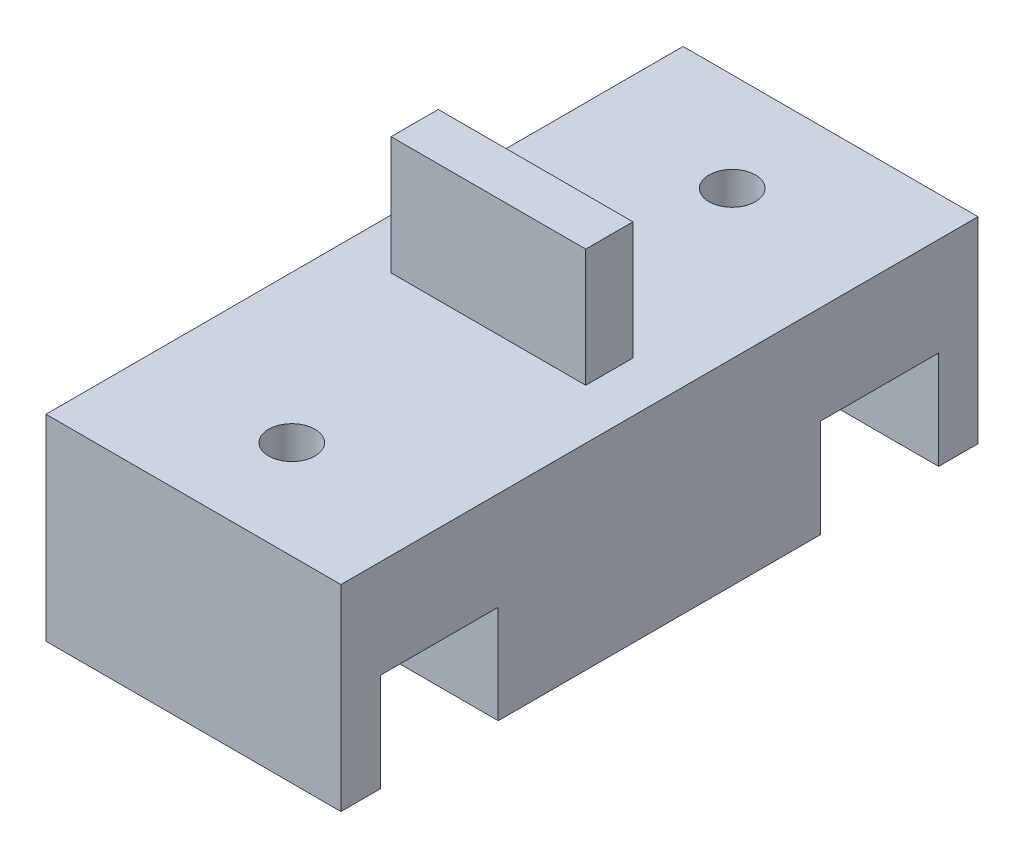
ISO-10303-21;
HEADER;
FILE_DESCRIPTION(('STEP AP214'),'2;1');
FILE_NAME('part.step','',(''),(''),'','','');
FILE_SCHEMA(('AUTOMOTIVE_DESIGN { 1 0 10303 214 1 1 1 1 }'));
ENDSEC;
DATA;
#1=APPLICATION_CONTEXT('core data for automotive mechanical design processes');
#2=APPLICATION_PROTOCOL_DEFINITION('international standard','automotive_design',2000,#1);
#3=PRODUCT_CONTEXT('',#1,'mechanical');
#4=PRODUCT('Part','Part','',(#3));
#5=PRODUCT_RELATED_PRODUCT_CATEGORY('part','',(#4));
#6=PRODUCT_DEFINITION_FORMATION('','',#4);
#7=PRODUCT_DEFINITION_CONTEXT('part definition',#1,'design');
#8=PRODUCT_DEFINITION('design','',#6,#7);
#9=PRODUCT_DEFINITION_SHAPE('','',#8);
#10=(LENGTH_UNIT() NAMED_UNIT(*) SI_UNIT(.MILLI.,.METRE.));
#11=(NAMED_UNIT(*) PLANE_ANGLE_UNIT() SI_UNIT($,.RADIAN.));
#12=(NAMED_UNIT(*) SI_UNIT($,.STERADIAN.) SOLID_ANGLE_UNIT());
#13=UNCERTAINTY_MEASURE_WITH_UNIT(LENGTH_MEASURE(1.E-05),#10,'distance_accuracy_value','');
#14=(GEOMETRIC_REPRESENTATION_CONTEXT(3) GLOBAL_UNCERTAINTY_ASSIGNED_CONTEXT((#13)) GLOBAL_UNIT_ASSIGNED_CONTEXT((#10,
#11,#12)) REPRESENTATION_CONTEXT('',''));
#15=CARTESIAN_POINT('',(0.,0.,0.));
#16=DIRECTION('',(0.,0.,1.));
#17=DIRECTION('',(1.,0.,0.));
#18=AXIS2_PLACEMENT_3D('',#15,#16,#17);
#19=CARTESIAN_POINT('',(9.525,0.,0.));
#20=DIRECTION('',(0.,1.,0.));
#21=DIRECTION('',(0.,0.,1.));
#22=AXIS2_PLACEMENT_3D('',#19,#20,#21);
#23=PLANE('',#22);
#24=DIRECTION('',(-1.,0.,0.));
#25=VECTOR('',#24,1.);
#26=CARTESIAN_POINT('',(0.,0.,-18.034));
#27=LINE('',#26,#25);
#28=CARTESIAN_POINT('',(9.525,0.,-18.034));
#29=VERTEX_POINT('',#28);
#30=CARTESIAN_POINT('',(-9.525,0.,-18.034));
#31=VERTEX_POINT('',#30);
#32=EDGE_CURVE('E157',#29,#31,#27,.T.);
#33=ORIENTED_EDGE('',*,*,#32,.T.);
#34=DIRECTION('',(0.,0.,-1.));
#35=VECTOR('',#34,1.);
#36=CARTESIAN_POINT('',(-9.525,0.,0.));
#37=LINE('',#36,#35);
#38=CARTESIAN_POINT('',(-9.525,0.,-20.574));
#39=VERTEX_POINT('',#38);
#40=EDGE_CURVE('E276',#31,#39,#37,.T.);
#41=ORIENTED_EDGE('',*,*,#40,.T.);
#42=DIRECTION('',(-1.,0.,0.));
#43=VECTOR('',#42,1.);
#44=CARTESIAN_POINT('',(9.525,0.,-20.574));
#45=LINE('',#44,#43);
#46=CARTESIAN_POINT('',(9.525,0.,-20.574));
#47=VERTEX_POINT('',#46);
#48=EDGE_CURVE('E267',#47,#39,#45,.T.);
#49=ORIENTED_EDGE('',*,*,#48,.F.);
#50=DIRECTION('',(0.,0.,-1.));
#51=VECTOR('',#50,1.);
#52=CARTESIAN_POINT('',(9.525,0.,0.));
#53=LINE('',#52,#51);
#54=EDGE_CURVE('E263',#29,#47,#53,.T.);
#55=ORIENTED_EDGE('',*,*,#54,.F.);
#56=EDGE_LOOP('',(#33,#41,#49,#55));
#57=FACE_BOUND('',#56,.T.);
#58=ADVANCED_FACE('F39',(#57),#23,.F.);
#59=DIRECTION('',(1.,0.,0.));
#60=VECTOR('',#59,1.);
#61=CARTESIAN_POINT('',(0.,0.,-10.414));
#62=LINE('',#61,#60);
#63=CARTESIAN_POINT('',(-9.525,0.,-10.414));
#64=VERTEX_POINT('',#63);
#65=CARTESIAN_POINT('',(9.525,0.,-10.414));
#66=VERTEX_POINT('',#65);
#67=EDGE_CURVE('E171',#64,#66,#62,.T.);
#68=ORIENTED_EDGE('',*,*,#67,.T.);
#69=CARTESIAN_POINT('',(9.525,0.,10.414));
#70=VERTEX_POINT('',#69);
#71=EDGE_CURVE('E268',#70,#66,#53,.T.);
#72=ORIENTED_EDGE('',*,*,#71,.F.);
#73=DIRECTION('',(1.,0.,0.));
#74=VECTOR('',#73,1.);
#75=CARTESIAN_POINT('',(0.,0.,10.414));
#76=LINE('',#75,#74);
#77=CARTESIAN_POINT('',(-9.525,0.,10.414));
#78=VERTEX_POINT('',#77);
#79=EDGE_CURVE('E194',#78,#70,#76,.T.);
#80=ORIENTED_EDGE('',*,*,#79,.F.);
#81=EDGE_CURVE('E279',#78,#64,#37,.T.);
#82=ORIENTED_EDGE('',*,*,#81,.T.);
#83=EDGE_LOOP('',(#68,#72,#80,#82));
#84=FACE_BOUND('',#83,.T.);
#85=ADVANCED_FACE('F306',(#84),#23,.F.);
#86=CARTESIAN_POINT('',(-9.525,0.,20.574));
#87=VERTEX_POINT('',#86);
#88=CARTESIAN_POINT('',(-9.525,0.,18.034));
#89=VERTEX_POINT('',#88);
#90=EDGE_CURVE('E258',#87,#89,#37,.T.);
#91=ORIENTED_EDGE('',*,*,#90,.T.);
#92=DIRECTION('',(-1.,0.,0.));
#93=VECTOR('',#92,1.);
#94=CARTESIAN_POINT('',(0.,0.,18.034));
#95=LINE('',#94,#93);
#96=CARTESIAN_POINT('',(9.525,0.,18.034));
#97=VERTEX_POINT('',#96);
#98=EDGE_CURVE('E205',#97,#89,#95,.T.);
#99=ORIENTED_EDGE('',*,*,#98,.F.);
#100=CARTESIAN_POINT('',(9.525,0.,20.574));
#101=VERTEX_POINT('',#100);
#102=EDGE_CURVE('E264',#101,#97,#53,.T.);
#103=ORIENTED_EDGE('',*,*,#102,.F.);
#104=DIRECTION('',(-1.,0.,0.));
#105=VECTOR('',#104,1.);
#106=CARTESIAN_POINT('',(9.525,0.,20.574));
#107=LINE('',#106,#105);
#108=EDGE_CURVE('E282',#101,#87,#107,.T.);
#109=ORIENTED_EDGE('',*,*,#108,.T.);
#110=EDGE_LOOP('',(#91,#99,#103,#109));
#111=FACE_BOUND('',#110,.T.);
#112=ADVANCED_FACE('F323',(#111),#23,.F.);
#113=CARTESIAN_POINT('',(9.525,0.,0.));
#114=DIRECTION('',(1.,0.,0.));
#115=DIRECTION('',(0.,0.,-1.));
#116=AXIS2_PLACEMENT_3D('',#113,#114,#115);
#117=PLANE('',#116);
#118=DIRECTION('',(0.,0.,1.));
#119=VECTOR('',#118,1.);
#120=CARTESIAN_POINT('',(9.525,6.35,0.));
#121=LINE('',#120,#119);
#122=CARTESIAN_POINT('',(9.525,6.35,-18.034));
#123=VERTEX_POINT('',#122);
#124=CARTESIAN_POINT('',(9.525,6.35,-10.414));
#125=VERTEX_POINT('',#124);
#126=EDGE_CURVE('E166',#123,#125,#121,.T.);
#127=ORIENTED_EDGE('',*,*,#126,.F.);
#128=DIRECTION('',(0.,-1.,0.));
#129=VECTOR('',#128,1.);
#130=CARTESIAN_POINT('',(9.525,6.35,-18.034));
#131=LINE('',#130,#129);
#132=EDGE_CURVE('E152',#123,#29,#131,.T.);
#133=ORIENTED_EDGE('',*,*,#132,.T.);
#134=ORIENTED_EDGE('',*,*,#54,.T.);
#135=DIRECTION('',(0.,-1.,0.));
#136=VECTOR('',#135,1.);
#137=CARTESIAN_POINT('',(9.525,0.,-20.574));
#138=LINE('',#137,#136);
#139=CARTESIAN_POINT('',(9.525,12.7,-20.574));
#140=VERTEX_POINT('',#139);
#141=EDGE_CURVE('E254',#140,#47,#138,.T.);
#142=ORIENTED_EDGE('',*,*,#141,.F.);
#143=DIRECTION('',(0.,0.,-1.));
#144=VECTOR('',#143,1.);
#145=CARTESIAN_POINT('',(9.525,12.7,0.));
#146=LINE('',#145,#144);
#147=CARTESIAN_POINT('',(9.525,12.7,20.574));
#148=VERTEX_POINT('',#147);
#149=EDGE_CURVE('E257',#148,#140,#146,.T.);
#150=ORIENTED_EDGE('',*,*,#149,.F.);
#151=DIRECTION('',(0.,-1.,0.));
#152=VECTOR('',#151,1.);
#153=CARTESIAN_POINT('',(9.525,0.,20.574));
#154=LINE('',#153,#152);
#155=EDGE_CURVE('E261',#148,#101,#154,.T.);
#156=ORIENTED_EDGE('',*,*,#155,.T.);
#157=ORIENTED_EDGE('',*,*,#102,.T.);
#158=DIRECTION('',(0.,-1.,0.));
#159=VECTOR('',#158,1.);
#160=CARTESIAN_POINT('',(9.525,6.35,18.034));
#161=LINE('',#160,#159);
#162=CARTESIAN_POINT('',(9.525,6.35,18.034));
#163=VERTEX_POINT('',#162);
#164=EDGE_CURVE('E182',#163,#97,#161,.T.);
#165=ORIENTED_EDGE('',*,*,#164,.F.);
#166=DIRECTION('',(0.,0.,1.));
#167=VECTOR('',#166,1.);
#168=CARTESIAN_POINT('',(9.525,6.35,0.));
#169=LINE('',#168,#167);
#170=CARTESIAN_POINT('',(9.525,6.35,10.414));
#171=VERTEX_POINT('',#170);
#172=EDGE_CURVE('E199',#171,#163,#169,.T.);
#173=ORIENTED_EDGE('',*,*,#172,.F.);
#174=DIRECTION('',(0.,-1.,0.));
#175=VECTOR('',#174,1.);
#176=CARTESIAN_POINT('',(9.525,6.35,10.414));
#177=LINE('',#176,#175);
#178=EDGE_CURVE('E209',#171,#70,#177,.T.);
#179=ORIENTED_EDGE('',*,*,#178,.T.);
#180=ORIENTED_EDGE('',*,*,#71,.T.);
#181=DIRECTION('',(0.,-1.,0.));
#182=VECTOR('',#181,1.);
#183=CARTESIAN_POINT('',(9.525,6.35,-10.414));
#184=LINE('',#183,#182);
#185=EDGE_CURVE('E161',#125,#66,#184,.T.);
#186=ORIENTED_EDGE('',*,*,#185,.F.);
#187=EDGE_LOOP('',(#127,#133,#134,#142,#150,#156,#157,#165,#173,#179,#180,#186));
#188=FACE_BOUND('',#187,.T.);
#189=ADVANCED_FACE('F173',(#188),#117,.T.);
#190=CARTESIAN_POINT('',(-9.525,0.,0.));
#191=DIRECTION('',(1.,0.,0.));
#192=DIRECTION('',(0.,0.,-1.));
#193=AXIS2_PLACEMENT_3D('',#190,#191,#192);
#194=PLANE('',#193);
#195=DIRECTION('',(0.,-1.,0.));
#196=VECTOR('',#195,1.);
#197=CARTESIAN_POINT('',(-9.525,6.35,-18.034));
#198=LINE('',#197,#196);
#199=CARTESIAN_POINT('',(-9.525,6.35,-18.034));
#200=VERTEX_POINT('',#199);
#201=EDGE_CURVE('E185',#200,#31,#198,.T.);
#202=ORIENTED_EDGE('',*,*,#201,.F.);
#203=DIRECTION('',(0.,0.,-1.));
#204=VECTOR('',#203,1.);
#205=CARTESIAN_POINT('',(-9.525,6.35,0.));
#206=LINE('',#205,#204);
#207=CARTESIAN_POINT('',(-9.525,6.35,-10.414));
#208=VERTEX_POINT('',#207);
#209=EDGE_CURVE('E169',#208,#200,#206,.T.);
#210=ORIENTED_EDGE('',*,*,#209,.F.);
#211=DIRECTION('',(0.,-1.,0.));
#212=VECTOR('',#211,1.);
#213=CARTESIAN_POINT('',(-9.525,6.35,-10.414));
#214=LINE('',#213,#212);
#215=EDGE_CURVE('E188',#208,#64,#214,.T.);
#216=ORIENTED_EDGE('',*,*,#215,.T.);
#217=ORIENTED_EDGE('',*,*,#81,.F.);
#218=DIRECTION('',(0.,-1.,0.));
#219=VECTOR('',#218,1.);
#220=CARTESIAN_POINT('',(-9.525,6.35,10.414));
#221=LINE('',#220,#219);
#222=CARTESIAN_POINT('',(-9.525,6.35,10.414));
#223=VERTEX_POINT('',#222);
#224=EDGE_CURVE('E212',#223,#78,#221,.T.);
#225=ORIENTED_EDGE('',*,*,#224,.F.);
#226=DIRECTION('',(0.,0.,-1.));
#227=VECTOR('',#226,1.);
#228=CARTESIAN_POINT('',(-9.525,6.35,0.));
#229=LINE('',#228,#227);
#230=CARTESIAN_POINT('',(-9.525,6.35,18.034));
#231=VERTEX_POINT('',#230);
#232=EDGE_CURVE('E193',#231,#223,#229,.T.);
#233=ORIENTED_EDGE('',*,*,#232,.F.);
#234=DIRECTION('',(0.,-1.,0.));
#235=VECTOR('',#234,1.);
#236=CARTESIAN_POINT('',(-9.525,6.35,18.034));
#237=LINE('',#236,#235);
#238=EDGE_CURVE('E204',#231,#89,#237,.T.);
#239=ORIENTED_EDGE('',*,*,#238,.T.);
#240=ORIENTED_EDGE('',*,*,#90,.F.);
#241=DIRECTION('',(0.,-1.,0.));
#242=VECTOR('',#241,1.);
#243=CARTESIAN_POINT('',(-9.525,0.,20.574));
#244=LINE('',#243,#242);
#245=CARTESIAN_POINT('',(-9.525,12.7,20.574));
#246=VERTEX_POINT('',#245);
#247=EDGE_CURVE('E274',#246,#87,#244,.T.);
#248=ORIENTED_EDGE('',*,*,#247,.F.);
#249=DIRECTION('',(0.,0.,-1.));
#250=VECTOR('',#249,1.);
#251=CARTESIAN_POINT('',(-9.525,12.7,0.));
#252=LINE('',#251,#250);
#253=CARTESIAN_POINT('',(-9.525,12.7,-20.574));
#254=VERTEX_POINT('',#253);
#255=EDGE_CURVE('E271',#246,#254,#252,.T.);
#256=ORIENTED_EDGE('',*,*,#255,.T.);
#257=DIRECTION('',(0.,-1.,0.));
#258=VECTOR('',#257,1.);
#259=CARTESIAN_POINT('',(-9.525,0.,-20.574));
#260=LINE('',#259,#258);
#261=EDGE_CURVE('E253',#254,#39,#260,.T.);
#262=ORIENTED_EDGE('',*,*,#261,.T.);
#263=ORIENTED_EDGE('',*,*,#40,.F.);
#264=EDGE_LOOP('',(#202,#210,#216,#217,#225,#233,#239,#240,#248,#256,#262,#263));
#265=FACE_BOUND('',#264,.T.);
#266=ADVANCED_FACE('F294',(#265),#194,.F.);
#267=CARTESIAN_POINT('',(0.,0.,-14.224));
#268=DIRECTION('',(0.,1.,0.));
#269=DIRECTION('',(0.,0.,1.));
#270=AXIS2_PLACEMENT_3D('',#267,#268,#269);
#271=CYLINDRICAL_SURFACE('',#270,1.5);
#272=CARTESIAN_POINT('',(0.,12.7,-14.224));
#273=DIRECTION('',(0.,1.,0.));
#274=DIRECTION('',(0.,0.,1.));
#275=AXIS2_PLACEMENT_3D('',#272,#273,#274);
#276=CIRCLE('',#275,1.5);
#277=CARTESIAN_POINT('',(0.,12.7,-12.724));
#278=VERTEX_POINT('',#277);
#279=EDGE_CURVE('E187',#278,#278,#276,.T.);
#280=ORIENTED_EDGE('',*,*,#279,.T.);
#281=EDGE_LOOP('',(#280));
#282=FACE_BOUND('',#281,.T.);
#283=CARTESIAN_POINT('',(0.,6.35,-14.224));
#284=DIRECTION('',(0.,-1.,0.));
#285=DIRECTION('',(0.,0.,-1.));
#286=AXIS2_PLACEMENT_3D('',#283,#284,#285);
#287=CIRCLE('',#286,1.5);
#288=CARTESIAN_POINT('',(0.,6.35,-15.724));
#289=VERTEX_POINT('',#288);
#290=EDGE_CURVE('E162',#289,#289,#287,.F.);
#291=ORIENTED_EDGE('',*,*,#290,.F.);
#292=EDGE_LOOP('',(#291));
#293=FACE_BOUND('',#292,.T.);
#294=ADVANCED_FACE('F360',(#282,#293),#271,.F.);
#295=CARTESIAN_POINT('',(0.,0.,14.224));
#296=DIRECTION('',(0.,1.,0.));
#297=DIRECTION('',(0.,0.,1.));
#298=AXIS2_PLACEMENT_3D('',#295,#296,#297);
#299=CYLINDRICAL_SURFACE('',#298,1.5);
#300=CARTESIAN_POINT('',(0.,12.7,14.224));
#301=DIRECTION('',(0.,1.,0.));
#302=DIRECTION('',(0.,0.,1.));
#303=AXIS2_PLACEMENT_3D('',#300,#301,#302);
#304=CIRCLE('',#303,1.5);
#305=CARTESIAN_POINT('',(0.,12.7,15.724));
#306=VERTEX_POINT('',#305);
#307=EDGE_CURVE('E216',#306,#306,#304,.T.);
#308=ORIENTED_EDGE('',*,*,#307,.T.);
#309=EDGE_LOOP('',(#308));
#310=FACE_BOUND('',#309,.T.);
#311=CARTESIAN_POINT('',(0.,6.35,14.224));
#312=DIRECTION('',(0.,-1.,0.));
#313=DIRECTION('',(0.,0.,-1.));
#314=AXIS2_PLACEMENT_3D('',#311,#312,#313);
#315=CIRCLE('',#314,1.5);
#316=CARTESIAN_POINT('',(0.,6.35,12.724));
#317=VERTEX_POINT('',#316);
#318=EDGE_CURVE('E201',#317,#317,#315,.F.);
#319=ORIENTED_EDGE('',*,*,#318,.F.);
#320=EDGE_LOOP('',(#319));
#321=FACE_BOUND('',#320,.T.);
#322=ADVANCED_FACE('F357',(#310,#321),#299,.F.);
#323=CARTESIAN_POINT('',(9.525,0.,-20.574));
#324=DIRECTION('',(0.,0.,-1.));
#325=DIRECTION('',(0.,1.,0.));
#326=AXIS2_PLACEMENT_3D('',#323,#324,#325);
#327=PLANE('',#326);
#328=ORIENTED_EDGE('',*,*,#261,.F.);
#329=DIRECTION('',(-1.,0.,0.));
#330=VECTOR('',#329,1.);
#331=CARTESIAN_POINT('',(9.525,12.7,-20.574));
#332=LINE('',#331,#330);
#333=EDGE_CURVE('E11',#140,#254,#332,.T.);
#334=ORIENTED_EDGE('',*,*,#333,.F.);
#335=ORIENTED_EDGE('',*,*,#141,.T.);
#336=ORIENTED_EDGE('',*,*,#48,.T.);
#337=EDGE_LOOP('',(#328,#334,#335,#336));
#338=FACE_BOUND('',#337,.T.);
#339=ADVANCED_FACE('F41',(#338),#327,.T.);
#340=CARTESIAN_POINT('',(9.525,12.7,0.));
#341=DIRECTION('',(0.,1.,0.));
#342=DIRECTION('',(0.,0.,1.));
#343=AXIS2_PLACEMENT_3D('',#340,#341,#342);
#344=PLANE('',#343);
#345=ORIENTED_EDGE('',*,*,#307,.F.);
#346=EDGE_LOOP('',(#345));
#347=FACE_BOUND('',#346,.T.);
#348=ORIENTED_EDGE('',*,*,#279,.F.);
#349=EDGE_LOOP('',(#348));
#350=FACE_BOUND('',#349,.T.);
#351=DIRECTION('',(0.,0.,-1.));
#352=VECTOR('',#351,1.);
#353=CARTESIAN_POINT('',(6.2865,12.7,0.));
#354=LINE('',#353,#352);
#355=CARTESIAN_POINT('',(6.2865,12.7,1.524));
#356=VERTEX_POINT('',#355);
#357=CARTESIAN_POINT('',(6.2865,12.7,-1.524));
#358=VERTEX_POINT('',#357);
#359=EDGE_CURVE('E222',#356,#358,#354,.T.);
#360=ORIENTED_EDGE('',*,*,#359,.F.);
#361=DIRECTION('',(-1.,0.,0.));
#362=VECTOR('',#361,1.);
#363=CARTESIAN_POINT('',(6.2865,12.7,1.524));
#364=LINE('',#363,#362);
#365=CARTESIAN_POINT('',(-6.2865,12.7,1.524));
#366=VERTEX_POINT('',#365);
#367=EDGE_CURVE('E234',#356,#366,#364,.T.);
#368=ORIENTED_EDGE('',*,*,#367,.T.);
#369=DIRECTION('',(0.,0.,-1.));
#370=VECTOR('',#369,1.);
#371=CARTESIAN_POINT('',(-6.2865,12.7,0.));
#372=LINE('',#371,#370);
#373=CARTESIAN_POINT('',(-6.2865,12.7,-1.524));
#374=VERTEX_POINT('',#373);
#375=EDGE_CURVE('E219',#366,#374,#372,.T.);
#376=ORIENTED_EDGE('',*,*,#375,.T.);
#377=DIRECTION('',(-1.,0.,0.));
#378=VECTOR('',#377,1.);
#379=CARTESIAN_POINT('',(6.2865,12.7,-1.524));
#380=LINE('',#379,#378);
#381=EDGE_CURVE('E251',#358,#374,#380,.T.);
#382=ORIENTED_EDGE('',*,*,#381,.F.);
#383=EDGE_LOOP('',(#360,#368,#376,#382));
#384=FACE_BOUND('',#383,.T.);
#385=ORIENTED_EDGE('',*,*,#255,.F.);
#386=DIRECTION('',(-1.,0.,0.));
#387=VECTOR('',#386,1.);
#388=CARTESIAN_POINT('',(9.525,12.7,20.574));
#389=LINE('',#388,#387);
#390=EDGE_CURVE('E47',#148,#246,#389,.T.);
#391=ORIENTED_EDGE('',*,*,#390,.F.);
#392=ORIENTED_EDGE('',*,*,#149,.T.);
#393=ORIENTED_EDGE('',*,*,#333,.T.);
#394=EDGE_LOOP('',(#385,#391,#392,#393));
#395=FACE_BOUND('',#394,.T.);
#396=ADVANCED_FACE('F295',(#347,#350,#384,#395),#344,.T.);
#397=CARTESIAN_POINT('',(9.525,0.,20.574));
#398=DIRECTION('',(0.,0.,-1.));
#399=DIRECTION('',(0.,1.,0.));
#400=AXIS2_PLACEMENT_3D('',#397,#398,#399);
#401=PLANE('',#400);
#402=ORIENTED_EDGE('',*,*,#247,.T.);
#403=ORIENTED_EDGE('',*,*,#108,.F.);
#404=ORIENTED_EDGE('',*,*,#155,.F.);
#405=ORIENTED_EDGE('',*,*,#390,.T.);
#406=EDGE_LOOP('',(#402,#403,#404,#405));
#407=FACE_BOUND('',#406,.T.);
#408=ADVANCED_FACE('F287',(#407),#401,.F.);
#409=CARTESIAN_POINT('',(6.2865,0.,-1.524));
#410=DIRECTION('',(0.,0.,1.));
#411=DIRECTION('',(0.,-1.,0.));
#412=AXIS2_PLACEMENT_3D('',#409,#410,#411);
#413=PLANE('',#412);
#414=DIRECTION('',(0.,1.,0.));
#415=VECTOR('',#414,1.);
#416=CARTESIAN_POINT('',(-6.2865,0.,-1.524));
#417=LINE('',#416,#415);
#418=CARTESIAN_POINT('',(-6.2865,20.32,-1.524));
#419=VERTEX_POINT('',#418);
#420=EDGE_CURVE('E237',#374,#419,#417,.T.);
#421=ORIENTED_EDGE('',*,*,#420,.T.);
#422=DIRECTION('',(-1.,0.,0.));
#423=VECTOR('',#422,1.);
#424=CARTESIAN_POINT('',(6.2865,20.32,-1.524));
#425=LINE('',#424,#423);
#426=CARTESIAN_POINT('',(6.2865,20.32,-1.524));
#427=VERTEX_POINT('',#426);
#428=EDGE_CURVE('E249',#427,#419,#425,.T.);
#429=ORIENTED_EDGE('',*,*,#428,.F.);
#430=DIRECTION('',(0.,1.,0.));
#431=VECTOR('',#430,1.);
#432=CARTESIAN_POINT('',(6.2865,0.,-1.524));
#433=LINE('',#432,#431);
#434=EDGE_CURVE('E225',#358,#427,#433,.T.);
#435=ORIENTED_EDGE('',*,*,#434,.F.);
#436=ORIENTED_EDGE('',*,*,#381,.T.);
#437=EDGE_LOOP('',(#421,#429,#435,#436));
#438=FACE_BOUND('',#437,.T.);
#439=ADVANCED_FACE('F375',(#438),#413,.F.);
#440=CARTESIAN_POINT('',(6.2865,20.32,0.));
#441=DIRECTION('',(0.,1.,0.));
#442=DIRECTION('',(0.,0.,1.));
#443=AXIS2_PLACEMENT_3D('',#440,#441,#442);
#444=PLANE('',#443);
#445=DIRECTION('',(0.,0.,-1.));
#446=VECTOR('',#445,1.);
#447=CARTESIAN_POINT('',(-6.2865,20.32,0.));
#448=LINE('',#447,#446);
#449=CARTESIAN_POINT('',(-6.2865,20.32,1.524));
#450=VERTEX_POINT('',#449);
#451=EDGE_CURVE('E240',#450,#419,#448,.T.);
#452=ORIENTED_EDGE('',*,*,#451,.F.);
#453=DIRECTION('',(-1.,0.,0.));
#454=VECTOR('',#453,1.);
#455=CARTESIAN_POINT('',(6.2865,20.32,1.524));
#456=LINE('',#455,#454);
#457=CARTESIAN_POINT('',(6.2865,20.32,1.524));
#458=VERTEX_POINT('',#457);
#459=EDGE_CURVE('E247',#458,#450,#456,.T.);
#460=ORIENTED_EDGE('',*,*,#459,.F.);
#461=DIRECTION('',(0.,0.,-1.));
#462=VECTOR('',#461,1.);
#463=CARTESIAN_POINT('',(6.2865,20.32,0.));
#464=LINE('',#463,#462);
#465=EDGE_CURVE('E228',#458,#427,#464,.T.);
#466=ORIENTED_EDGE('',*,*,#465,.T.);
#467=ORIENTED_EDGE('',*,*,#428,.T.);
#468=EDGE_LOOP('',(#452,#460,#466,#467));
#469=FACE_BOUND('',#468,.T.);
#470=ADVANCED_FACE('F371',(#469),#444,.T.);
#471=CARTESIAN_POINT('',(6.2865,0.,1.52399999999999));
#472=DIRECTION('',(0.,0.,1.));
#473=DIRECTION('',(0.,-1.,0.));
#474=AXIS2_PLACEMENT_3D('',#471,#472,#473);
#475=PLANE('',#474);
#476=DIRECTION('',(0.,1.,0.));
#477=VECTOR('',#476,1.);
#478=CARTESIAN_POINT('',(-6.2865,0.,1.52399999999999));
#479=LINE('',#478,#477);
#480=EDGE_CURVE('E226',#366,#450,#479,.T.);
#481=ORIENTED_EDGE('',*,*,#480,.F.);
#482=ORIENTED_EDGE('',*,*,#367,.F.);
#483=DIRECTION('',(0.,1.,0.));
#484=VECTOR('',#483,1.);
#485=CARTESIAN_POINT('',(6.2865,0.,1.52399999999999));
#486=LINE('',#485,#484);
#487=EDGE_CURVE('E231',#356,#458,#486,.T.);
#488=ORIENTED_EDGE('',*,*,#487,.T.);
#489=ORIENTED_EDGE('',*,*,#459,.T.);
#490=EDGE_LOOP('',(#481,#482,#488,#489));
#491=FACE_BOUND('',#490,.T.);
#492=ADVANCED_FACE('F366',(#491),#475,.T.);
#493=CARTESIAN_POINT('',(6.2865,0.,0.));
#494=DIRECTION('',(1.,0.,0.));
#495=DIRECTION('',(0.,0.,-1.));
#496=AXIS2_PLACEMENT_3D('',#493,#494,#495);
#497=PLANE('',#496);
#498=ORIENTED_EDGE('',*,*,#359,.T.);
#499=ORIENTED_EDGE('',*,*,#434,.T.);
#500=ORIENTED_EDGE('',*,*,#465,.F.);
#501=ORIENTED_EDGE('',*,*,#487,.F.);
#502=EDGE_LOOP('',(#498,#499,#500,#501));
#503=FACE_BOUND('',#502,.T.);
#504=ADVANCED_FACE('F352',(#503),#497,.T.);
#505=CARTESIAN_POINT('',(-6.2865,0.,0.));
#506=DIRECTION('',(1.,0.,0.));
#507=DIRECTION('',(0.,0.,-1.));
#508=AXIS2_PLACEMENT_3D('',#505,#506,#507);
#509=PLANE('',#508);
#510=ORIENTED_EDGE('',*,*,#375,.F.);
#511=ORIENTED_EDGE('',*,*,#480,.T.);
#512=ORIENTED_EDGE('',*,*,#451,.T.);
#513=ORIENTED_EDGE('',*,*,#420,.F.);
#514=EDGE_LOOP('',(#510,#511,#512,#513));
#515=FACE_BOUND('',#514,.T.);
#516=ADVANCED_FACE('F345',(#515),#509,.F.);
#517=CARTESIAN_POINT('',(0.,6.35,18.034));
#518=DIRECTION('',(0.,0.,1.));
#519=DIRECTION('',(0.,-1.,0.));
#520=AXIS2_PLACEMENT_3D('',#517,#518,#519);
#521=PLANE('',#520);
#522=ORIENTED_EDGE('',*,*,#98,.T.);
#523=ORIENTED_EDGE('',*,*,#238,.F.);
#524=DIRECTION('',(-1.,0.,0.));
#525=VECTOR('',#524,1.);
#526=CARTESIAN_POINT('',(0.,6.35,18.034));
#527=LINE('',#526,#525);
#528=EDGE_CURVE('E62',#163,#231,#527,.T.);
#529=ORIENTED_EDGE('',*,*,#528,.F.);
#530=ORIENTED_EDGE('',*,*,#164,.T.);
#531=EDGE_LOOP('',(#522,#523,#529,#530));
#532=FACE_BOUND('',#531,.T.);
#533=ADVANCED_FACE('F343',(#532),#521,.F.);
#534=CARTESIAN_POINT('',(0.,6.35,10.414));
#535=DIRECTION('',(0.,0.,-1.));
#536=DIRECTION('',(0.,1.,0.));
#537=AXIS2_PLACEMENT_3D('',#534,#535,#536);
#538=PLANE('',#537);
#539=ORIENTED_EDGE('',*,*,#79,.T.);
#540=ORIENTED_EDGE('',*,*,#178,.F.);
#541=DIRECTION('',(1.,0.,0.));
#542=VECTOR('',#541,1.);
#543=CARTESIAN_POINT('',(0.,6.35,10.414));
#544=LINE('',#543,#542);
#545=EDGE_CURVE('E196',#223,#171,#544,.T.);
#546=ORIENTED_EDGE('',*,*,#545,.F.);
#547=ORIENTED_EDGE('',*,*,#224,.T.);
#548=EDGE_LOOP('',(#539,#540,#546,#547));
#549=FACE_BOUND('',#548,.T.);
#550=ADVANCED_FACE('F340',(#549),#538,.F.);
#551=CARTESIAN_POINT('',(0.,6.35,0.));
#552=DIRECTION('',(0.,-1.,0.));
#553=DIRECTION('',(0.,0.,-1.));
#554=AXIS2_PLACEMENT_3D('',#551,#552,#553);
#555=PLANE('',#554);
#556=ORIENTED_EDGE('',*,*,#528,.T.);
#557=ORIENTED_EDGE('',*,*,#232,.T.);
#558=ORIENTED_EDGE('',*,*,#545,.T.);
#559=ORIENTED_EDGE('',*,*,#172,.T.);
#560=EDGE_LOOP('',(#556,#557,#558,#559));
#561=FACE_BOUND('',#560,.T.);
#562=ORIENTED_EDGE('',*,*,#318,.T.);
#563=EDGE_LOOP('',(#562));
#564=FACE_BOUND('',#563,.T.);
#565=ADVANCED_FACE('F319',(#561,#564),#555,.T.);
#566=CARTESIAN_POINT('',(0.,6.35,-18.034));
#567=DIRECTION('',(0.,0.,1.));
#568=DIRECTION('',(1.,0.,0.));
#569=AXIS2_PLACEMENT_3D('',#566,#567,#568);
#570=PLANE('',#569);
#571=ORIENTED_EDGE('',*,*,#32,.F.);
#572=ORIENTED_EDGE('',*,*,#132,.F.);
#573=DIRECTION('',(-1.,0.,0.));
#574=VECTOR('',#573,1.);
#575=CARTESIAN_POINT('',(0.,6.35,-18.034));
#576=LINE('',#575,#574);
#577=EDGE_CURVE('E155',#123,#200,#576,.T.);
#578=ORIENTED_EDGE('',*,*,#577,.T.);
#579=ORIENTED_EDGE('',*,*,#201,.T.);
#580=EDGE_LOOP('',(#571,#572,#578,#579));
#581=FACE_BOUND('',#580,.T.);
#582=ADVANCED_FACE('F154',(#581),#570,.T.);
#583=CARTESIAN_POINT('',(0.,6.35,-10.414));
#584=DIRECTION('',(0.,0.,-1.));
#585=DIRECTION('',(0.,1.,0.));
#586=AXIS2_PLACEMENT_3D('',#583,#584,#585);
#587=PLANE('',#586);
#588=ORIENTED_EDGE('',*,*,#67,.F.);
#589=ORIENTED_EDGE('',*,*,#215,.F.);
#590=DIRECTION('',(1.,0.,0.));
#591=VECTOR('',#590,1.);
#592=CARTESIAN_POINT('',(0.,6.35,-10.414));
#593=LINE('',#592,#591);
#594=EDGE_CURVE('E54',#208,#125,#593,.T.);
#595=ORIENTED_EDGE('',*,*,#594,.T.);
#596=ORIENTED_EDGE('',*,*,#185,.T.);
#597=EDGE_LOOP('',(#588,#589,#595,#596));
#598=FACE_BOUND('',#597,.T.);
#599=ADVANCED_FACE('F311',(#598),#587,.T.);
#600=CARTESIAN_POINT('',(0.,6.35,0.));
#601=DIRECTION('',(0.,-1.,0.));
#602=DIRECTION('',(0.,0.,-1.));
#603=AXIS2_PLACEMENT_3D('',#600,#601,#602);
#604=PLANE('',#603);
#605=ORIENTED_EDGE('',*,*,#577,.F.);
#606=ORIENTED_EDGE('',*,*,#126,.T.);
#607=ORIENTED_EDGE('',*,*,#594,.F.);
#608=ORIENTED_EDGE('',*,*,#209,.T.);
#609=EDGE_LOOP('',(#605,#606,#607,#608));
#610=FACE_BOUND('',#609,.T.);
#611=ORIENTED_EDGE('',*,*,#290,.T.);
#612=EDGE_LOOP('',(#611));
#613=FACE_BOUND('',#612,.T.);
#614=ADVANCED_FACE('F164',(#610,#613),#604,.T.);
#615=CLOSED_SHELL('',(#58,#85,#112,#189,#266,#294,#322,#339,#396,#408,#439,#470,#492,#504,#516,
#533,#550,#565,#582,#599,#614));
#616=MANIFOLD_SOLID_BREP('B2',#615);
#617=ADVANCED_BREP_SHAPE_REPRESENTATION('',(#18,#616),#14);
#618=SHAPE_DEFINITION_REPRESENTATION(#9,#617);
ENDSEC;
END-ISO-10303-21;
